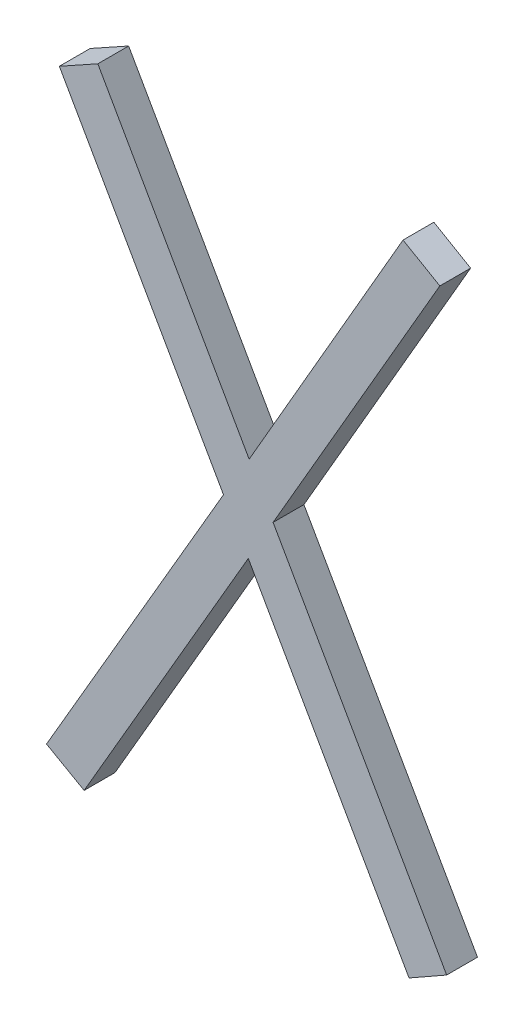
ISO-10303-21;
HEADER;
FILE_DESCRIPTION(('STEP AP214'),'2;1');
FILE_NAME('part.step','',(''),(''),'','','');
FILE_SCHEMA(('AUTOMOTIVE_DESIGN { 1 0 10303 214 1 1 1 1 }'));
ENDSEC;
DATA;
#1=APPLICATION_CONTEXT('core data for automotive mechanical design processes');
#2=APPLICATION_PROTOCOL_DEFINITION('international standard','automotive_design',2000,#1);
#3=PRODUCT_CONTEXT('',#1,'mechanical');
#4=PRODUCT('Part','Part','',(#3));
#5=PRODUCT_RELATED_PRODUCT_CATEGORY('part','',(#4));
#6=PRODUCT_DEFINITION_FORMATION('','',#4);
#7=PRODUCT_DEFINITION_CONTEXT('part definition',#1,'design');
#8=PRODUCT_DEFINITION('design','',#6,#7);
#9=PRODUCT_DEFINITION_SHAPE('','',#8);
#10=(LENGTH_UNIT() NAMED_UNIT(*) SI_UNIT(.MILLI.,.METRE.));
#11=(NAMED_UNIT(*) PLANE_ANGLE_UNIT() SI_UNIT($,.RADIAN.));
#12=(NAMED_UNIT(*) SI_UNIT($,.STERADIAN.) SOLID_ANGLE_UNIT());
#13=UNCERTAINTY_MEASURE_WITH_UNIT(LENGTH_MEASURE(1.E-05),#10,'distance_accuracy_value','');
#14=(GEOMETRIC_REPRESENTATION_CONTEXT(3) GLOBAL_UNCERTAINTY_ASSIGNED_CONTEXT((#13)) GLOBAL_UNIT_ASSIGNED_CONTEXT((#10,
#11,#12)) REPRESENTATION_CONTEXT('',''));
#15=CARTESIAN_POINT('',(0.,0.,0.));
#16=DIRECTION('',(0.,0.,1.));
#17=DIRECTION('',(1.,0.,0.));
#18=AXIS2_PLACEMENT_3D('',#15,#16,#17);
#19=CARTESIAN_POINT('',(91.9707697498928,58.3126359816952,-39.1));
#20=DIRECTION('',(0.,0.,-1.));
#21=DIRECTION('',(-1.,0.,0.));
#22=AXIS2_PLACEMENT_3D('',#19,#20,#21);
#23=PLANE('',#22);
#24=DIRECTION('',(-0.493874000371217,0.869533479376919,0.));
#25=VECTOR('',#24,1.);
#26=CARTESIAN_POINT('',(92.620836084824,59.1640593303503,-39.1));
#27=LINE('',#26,#25);
#28=CARTESIAN_POINT('',(93.1423340043933,58.2458901208959,-39.1));
#29=VERTEX_POINT('',#28);
#30=CARTESIAN_POINT('',(92.6208360848072,59.1640593303407,-39.1));
#31=VERTEX_POINT('',#30);
#32=EDGE_CURVE('E159',#29,#31,#27,.T.);
#33=ORIENTED_EDGE('',*,*,#32,.T.);
#34=DIRECTION('',(-0.501757199087613,-0.865008504677124,0.));
#35=VECTOR('',#34,1.);
#36=CARTESIAN_POINT('',(92.0882424648369,58.2458901209322,-39.1));
#37=LINE('',#36,#35);
#38=CARTESIAN_POINT('',(92.0882424648636,58.2458901209166,-39.1));
#39=VERTEX_POINT('',#38);
#40=EDGE_CURVE('E164',#31,#39,#37,.T.);
#41=ORIENTED_EDGE('',*,*,#40,.T.);
#42=DIRECTION('',(-0.86945655739274,0.494009407609576,0.));
#43=VECTOR('',#42,1.);
#44=CARTESIAN_POINT('',(91.9661897602962,58.3152382485114,-39.1));
#45=LINE('',#44,#43);
#46=CARTESIAN_POINT('',(91.9661897602962,58.3152382485114,-39.1));
#47=VERTEX_POINT('',#46);
#48=EDGE_CURVE('E106',#39,#47,#45,.T.);
#49=ORIENTED_EDGE('',*,*,#48,.T.);
#50=DIRECTION('',(0.502662662857917,0.864482647233933,0.));
#51=VECTOR('',#50,1.);
#52=CARTESIAN_POINT('',(92.5403922568138,59.3027555855175,-39.1));
#53=LINE('',#52,#51);
#54=CARTESIAN_POINT('',(92.540392256802,59.3027555855243,-39.1));
#55=VERTEX_POINT('',#54);
#56=EDGE_CURVE('E20',#47,#55,#53,.T.);
#57=ORIENTED_EDGE('',*,*,#56,.T.);
#58=DIRECTION('',(-0.493921009717616,0.869506777523632,0.));
#59=VECTOR('',#58,1.);
#60=CARTESIAN_POINT('',(92.0077986368354,60.2403422706599,-39.1));
#61=LINE('',#60,#59);
#62=CARTESIAN_POINT('',(92.0077986368628,60.2403422706755,-39.1));
#63=VERTEX_POINT('',#62);
#64=EDGE_CURVE('E103',#55,#63,#61,.T.);
#65=ORIENTED_EDGE('',*,*,#64,.T.);
#66=DIRECTION('',(0.874157276121612,0.485642931178499,0.));
#67=VECTOR('',#66,1.);
#68=CARTESIAN_POINT('',(92.1326252665092,60.3096903982572,-39.1));
#69=LINE('',#68,#67);
#70=CARTESIAN_POINT('',(92.1326252665095,60.3096903982573,-39.1));
#71=VERTEX_POINT('',#70);
#72=EDGE_CURVE('E124',#63,#71,#69,.T.);
#73=ORIENTED_EDGE('',*,*,#72,.T.);
#74=DIRECTION('',(0.493434547487693,-0.869782931164791,0.));
#75=VECTOR('',#74,1.);
#76=CARTESIAN_POINT('',(92.6236100099216,59.4442257658021,-39.1));
#77=LINE('',#76,#75);
#78=CARTESIAN_POINT('',(92.62361000994,59.4442257657843,-39.1));
#79=VERTEX_POINT('',#78);
#80=EDGE_CURVE('E129',#71,#79,#77,.T.);
#81=ORIENTED_EDGE('',*,*,#80,.T.);
#82=DIRECTION('',(0.499722453489593,0.866185586048592,0.));
#83=VECTOR('',#82,1.);
#84=CARTESIAN_POINT('',(93.1229165286308,60.3096903981744,-39.1));
#85=LINE('',#84,#83);
#86=CARTESIAN_POINT('',(93.1229165286308,60.3096903981744,-39.1));
#87=VERTEX_POINT('',#86);
#88=EDGE_CURVE('E134',#79,#87,#85,.T.);
#89=ORIENTED_EDGE('',*,*,#88,.T.);
#90=DIRECTION('',(0.864507186684219,-0.502620457374486,0.));
#91=VECTOR('',#90,1.);
#92=CARTESIAN_POINT('',(93.242195308049,60.2403422706057,-39.1));
#93=LINE('',#92,#91);
#94=CARTESIAN_POINT('',(93.2421953080429,60.2403422706092,-39.1));
#95=VERTEX_POINT('',#94);
#96=EDGE_CURVE('E139',#87,#95,#93,.T.);
#97=ORIENTED_EDGE('',*,*,#96,.T.);
#98=DIRECTION('',(-0.500833770570706,-0.865543490678504,0.));
#99=VECTOR('',#98,1.);
#100=CARTESIAN_POINT('',(92.7012799128295,59.3055295106763,-39.1));
#101=LINE('',#100,#99);
#102=CARTESIAN_POINT('',(92.7012799127852,59.3055295105927,-39.1));
#103=VERTEX_POINT('',#102);
#104=EDGE_CURVE('E144',#95,#103,#101,.T.);
#105=ORIENTED_EDGE('',*,*,#104,.T.);
#106=DIRECTION('',(0.494302224488511,-0.869290118927916,0.));
#107=VECTOR('',#106,1.);
#108=CARTESIAN_POINT('',(93.2643867089025,58.3152382484591,-39.1));
#109=LINE('',#108,#107);
#110=CARTESIAN_POINT('',(93.2643867089059,58.3152382484531,-39.1));
#111=VERTEX_POINT('',#110);
#112=EDGE_CURVE('E149',#103,#111,#109,.T.);
#113=ORIENTED_EDGE('',*,*,#112,.T.);
#114=DIRECTION('',(-0.869456557392783,-0.494009407609501,0.));
#115=VECTOR('',#114,1.);
#116=CARTESIAN_POINT('',(93.1423340043962,58.2458901208908,-39.1));
#117=LINE('',#116,#115);
#118=EDGE_CURVE('E154',#111,#29,#117,.T.);
#119=ORIENTED_EDGE('',*,*,#118,.T.);
#120=EDGE_LOOP('',(#33,#41,#49,#57,#65,#73,#81,#89,#97,#105,#113,#119));
#121=FACE_BOUND('',#120,.T.);
#122=ADVANCED_FACE('F17',(#121),#23,.T.);
#123=CARTESIAN_POINT('',(92.5403922568138,59.3027555855175,-39.));
#124=DIRECTION('',(0.864482647233933,-0.502662662857917,0.));
#125=DIRECTION('',(0.502662662857917,0.864482647233933,0.));
#126=AXIS2_PLACEMENT_3D('',#123,#124,#125);
#127=PLANE('',#126);
#128=DIRECTION('',(0.,0.,1.));
#129=VECTOR('',#128,1.);
#130=CARTESIAN_POINT('',(91.9661897602962,58.3152382485114,-39.));
#131=LINE('',#130,#129);
#132=CARTESIAN_POINT('',(91.9661897602962,58.3152382485114,-39.));
#133=VERTEX_POINT('',#132);
#134=EDGE_CURVE('E166',#47,#133,#131,.T.);
#135=ORIENTED_EDGE('',*,*,#134,.T.);
#136=DIRECTION('',(0.502662662837388,0.864482647245869,0.));
#137=VECTOR('',#136,1.);
#138=CARTESIAN_POINT('',(91.9661897602962,58.3152382485114,-39.));
#139=LINE('',#138,#137);
#140=CARTESIAN_POINT('',(92.540392256802,59.3027555855243,-39.));
#141=VERTEX_POINT('',#140);
#142=EDGE_CURVE('E121',#133,#141,#139,.T.);
#143=ORIENTED_EDGE('',*,*,#142,.T.);
#144=DIRECTION('',(0.,0.,1.));
#145=VECTOR('',#144,1.);
#146=CARTESIAN_POINT('',(92.5403922567903,59.3027555855311,-39.));
#147=LINE('',#146,#145);
#148=EDGE_CURVE('E111',#141,#55,#147,.F.);
#149=ORIENTED_EDGE('',*,*,#148,.T.);
#150=ORIENTED_EDGE('',*,*,#56,.F.);
#151=EDGE_LOOP('',(#135,#143,#149,#150));
#152=FACE_BOUND('',#151,.T.);
#153=ADVANCED_FACE('F120',(#152),#127,.F.);
#154=CARTESIAN_POINT('',(92.0077986368354,60.2403422706599,-39.));
#155=DIRECTION('',(0.869506777523632,0.493921009717616,0.));
#156=DIRECTION('',(-0.493921009717616,0.869506777523632,0.));
#157=AXIS2_PLACEMENT_3D('',#154,#155,#156);
#158=PLANE('',#157);
#159=ORIENTED_EDGE('',*,*,#148,.F.);
#160=DIRECTION('',(-0.493921009666716,0.869506777552545,0.));
#161=VECTOR('',#160,1.);
#162=CARTESIAN_POINT('',(92.5403922567903,59.3027555855311,-39.));
#163=LINE('',#162,#161);
#164=CARTESIAN_POINT('',(92.0077986368628,60.2403422706755,-39.));
#165=VERTEX_POINT('',#164);
#166=EDGE_CURVE('E171',#141,#165,#163,.T.);
#167=ORIENTED_EDGE('',*,*,#166,.T.);
#168=DIRECTION('',(0.,0.,1.));
#169=VECTOR('',#168,1.);
#170=CARTESIAN_POINT('',(92.0077986368903,60.2403422706912,-39.));
#171=LINE('',#170,#169);
#172=EDGE_CURVE('E117',#165,#63,#171,.F.);
#173=ORIENTED_EDGE('',*,*,#172,.T.);
#174=ORIENTED_EDGE('',*,*,#64,.F.);
#175=EDGE_LOOP('',(#159,#167,#173,#174));
#176=FACE_BOUND('',#175,.T.);
#177=ADVANCED_FACE('F114',(#176),#158,.F.);
#178=CARTESIAN_POINT('',(92.1326252665092,60.3096903982572,-39.));
#179=DIRECTION('',(0.485642931178499,-0.874157276121612,0.));
#180=DIRECTION('',(0.874157276121612,0.485642931178499,0.));
#181=AXIS2_PLACEMENT_3D('',#178,#179,#180);
#182=PLANE('',#181);
#183=ORIENTED_EDGE('',*,*,#172,.F.);
#184=DIRECTION('',(0.874157276121609,0.485642931178504,0.));
#185=VECTOR('',#184,1.);
#186=CARTESIAN_POINT('',(92.0077986368903,60.2403422706911,-39.));
#187=LINE('',#186,#185);
#188=CARTESIAN_POINT('',(92.1326252665095,60.3096903982573,-39.));
#189=VERTEX_POINT('',#188);
#190=EDGE_CURVE('E173',#165,#189,#187,.T.);
#191=ORIENTED_EDGE('',*,*,#190,.T.);
#192=DIRECTION('',(0.,0.,1.));
#193=VECTOR('',#192,1.);
#194=CARTESIAN_POINT('',(92.1326252665095,60.3096903982573,-39.));
#195=LINE('',#194,#193);
#196=EDGE_CURVE('E126',#189,#71,#195,.F.);
#197=ORIENTED_EDGE('',*,*,#196,.T.);
#198=ORIENTED_EDGE('',*,*,#72,.F.);
#199=EDGE_LOOP('',(#183,#191,#197,#198));
#200=FACE_BOUND('',#199,.T.);
#201=ADVANCED_FACE('F234',(#200),#182,.F.);
#202=CARTESIAN_POINT('',(92.6236100099216,59.4442257658021,-39.));
#203=DIRECTION('',(-0.869782931164791,-0.493434547487693,0.));
#204=DIRECTION('',(0.493434547487693,-0.869782931164791,0.));
#205=AXIS2_PLACEMENT_3D('',#202,#203,#204);
#206=PLANE('',#205);
#207=ORIENTED_EDGE('',*,*,#196,.F.);
#208=DIRECTION('',(0.493434547500377,-0.869782931157595,0.));
#209=VECTOR('',#208,1.);
#210=CARTESIAN_POINT('',(92.1326252665095,60.3096903982573,-39.));
#211=LINE('',#210,#209);
#212=CARTESIAN_POINT('',(92.62361000994,59.4442257657843,-39.));
#213=VERTEX_POINT('',#212);
#214=EDGE_CURVE('E176',#189,#213,#211,.T.);
#215=ORIENTED_EDGE('',*,*,#214,.T.);
#216=DIRECTION('',(0.,0.,1.));
#217=VECTOR('',#216,1.);
#218=CARTESIAN_POINT('',(92.6236100099463,59.4442257657879,-39.));
#219=LINE('',#218,#217);
#220=EDGE_CURVE('E131',#213,#79,#219,.F.);
#221=ORIENTED_EDGE('',*,*,#220,.T.);
#222=ORIENTED_EDGE('',*,*,#80,.F.);
#223=EDGE_LOOP('',(#207,#215,#221,#222));
#224=FACE_BOUND('',#223,.T.);
#225=ADVANCED_FACE('F231',(#224),#206,.F.);
#226=CARTESIAN_POINT('',(93.1229165286308,60.3096903981744,-39.));
#227=DIRECTION('',(0.866185586048592,-0.499722453489593,0.));
#228=DIRECTION('',(0.499722453489593,0.866185586048592,0.));
#229=AXIS2_PLACEMENT_3D('',#226,#227,#228);
#230=PLANE('',#229);
#231=ORIENTED_EDGE('',*,*,#220,.F.);
#232=DIRECTION('',(0.499722453489568,0.866185586048606,0.));
#233=VECTOR('',#232,1.);
#234=CARTESIAN_POINT('',(92.6236100099463,59.4442257657879,-39.));
#235=LINE('',#234,#233);
#236=CARTESIAN_POINT('',(93.1229165286308,60.3096903981744,-39.));
#237=VERTEX_POINT('',#236);
#238=EDGE_CURVE('E179',#213,#237,#235,.T.);
#239=ORIENTED_EDGE('',*,*,#238,.T.);
#240=DIRECTION('',(0.,0.,1.));
#241=VECTOR('',#240,1.);
#242=CARTESIAN_POINT('',(93.1229165286308,60.3096903981744,-39.));
#243=LINE('',#242,#241);
#244=EDGE_CURVE('E136',#237,#87,#243,.F.);
#245=ORIENTED_EDGE('',*,*,#244,.T.);
#246=ORIENTED_EDGE('',*,*,#88,.F.);
#247=EDGE_LOOP('',(#231,#239,#245,#246));
#248=FACE_BOUND('',#247,.T.);
#249=ADVANCED_FACE('F227',(#248),#230,.F.);
#250=CARTESIAN_POINT('',(93.242195308049,60.2403422706057,-39.));
#251=DIRECTION('',(-0.502620457374486,-0.864507186684219,0.));
#252=DIRECTION('',(0.864507186684219,-0.502620457374486,0.));
#253=AXIS2_PLACEMENT_3D('',#250,#251,#252);
#254=PLANE('',#253);
#255=ORIENTED_EDGE('',*,*,#244,.F.);
#256=DIRECTION('',(0.864507186684126,-0.502620457374645,0.));
#257=VECTOR('',#256,1.);
#258=CARTESIAN_POINT('',(93.1229165286308,60.3096903981744,-39.));
#259=LINE('',#258,#257);
#260=CARTESIAN_POINT('',(93.2421953080429,60.2403422706092,-39.));
#261=VERTEX_POINT('',#260);
#262=EDGE_CURVE('E182',#237,#261,#259,.T.);
#263=ORIENTED_EDGE('',*,*,#262,.T.);
#264=DIRECTION('',(0.,0.,1.));
#265=VECTOR('',#264,1.);
#266=CARTESIAN_POINT('',(93.242195308043,60.2403422706092,-39.));
#267=LINE('',#266,#265);
#268=EDGE_CURVE('E141',#261,#95,#267,.F.);
#269=ORIENTED_EDGE('',*,*,#268,.T.);
#270=ORIENTED_EDGE('',*,*,#96,.F.);
#271=EDGE_LOOP('',(#255,#263,#269,#270));
#272=FACE_BOUND('',#271,.T.);
#273=ADVANCED_FACE('F223',(#272),#254,.F.);
#274=CARTESIAN_POINT('',(92.7012799128295,59.3055295106763,-39.));
#275=DIRECTION('',(-0.865543490678504,0.500833770570706,0.));
#276=DIRECTION('',(-0.500833770570706,-0.865543490678504,0.));
#277=AXIS2_PLACEMENT_3D('',#274,#275,#276);
#278=PLANE('',#277);
#279=ORIENTED_EDGE('',*,*,#268,.F.);
#280=DIRECTION('',(-0.500833770565032,-0.865543490681787,0.));
#281=VECTOR('',#280,1.);
#282=CARTESIAN_POINT('',(93.2421953080429,60.2403422706092,-39.));
#283=LINE('',#282,#281);
#284=CARTESIAN_POINT('',(92.7012799127852,59.3055295105927,-39.));
#285=VERTEX_POINT('',#284);
#286=EDGE_CURVE('E185',#261,#285,#283,.T.);
#287=ORIENTED_EDGE('',*,*,#286,.T.);
#288=DIRECTION('',(0.,0.,1.));
#289=VECTOR('',#288,1.);
#290=CARTESIAN_POINT('',(92.7012799127883,59.3055295105909,-39.));
#291=LINE('',#290,#289);
#292=EDGE_CURVE('E146',#285,#103,#291,.F.);
#293=ORIENTED_EDGE('',*,*,#292,.T.);
#294=ORIENTED_EDGE('',*,*,#104,.F.);
#295=EDGE_LOOP('',(#279,#287,#293,#294));
#296=FACE_BOUND('',#295,.T.);
#297=ADVANCED_FACE('F219',(#296),#278,.F.);
#298=CARTESIAN_POINT('',(93.2643867089025,58.3152382484591,-39.));
#299=DIRECTION('',(-0.869290118927916,-0.494302224488511,0.));
#300=DIRECTION('',(0.494302224488511,-0.869290118927916,0.));
#301=AXIS2_PLACEMENT_3D('',#298,#299,#300);
#302=PLANE('',#301);
#303=ORIENTED_EDGE('',*,*,#292,.F.);
#304=DIRECTION('',(0.494302224488521,-0.86929011892791,0.));
#305=VECTOR('',#304,1.);
#306=CARTESIAN_POINT('',(92.7012799127882,59.3055295105909,-39.));
#307=LINE('',#306,#305);
#308=CARTESIAN_POINT('',(93.2643867089059,58.3152382484531,-39.));
#309=VERTEX_POINT('',#308);
#310=EDGE_CURVE('E188',#285,#309,#307,.T.);
#311=ORIENTED_EDGE('',*,*,#310,.T.);
#312=DIRECTION('',(0.,0.,1.));
#313=VECTOR('',#312,1.);
#314=CARTESIAN_POINT('',(93.2643867089059,58.3152382484531,-39.));
#315=LINE('',#314,#313);
#316=EDGE_CURVE('E151',#309,#111,#315,.F.);
#317=ORIENTED_EDGE('',*,*,#316,.T.);
#318=ORIENTED_EDGE('',*,*,#112,.F.);
#319=EDGE_LOOP('',(#303,#311,#317,#318));
#320=FACE_BOUND('',#319,.T.);
#321=ADVANCED_FACE('F215',(#320),#302,.F.);
#322=CARTESIAN_POINT('',(93.1423340043962,58.2458901208908,-39.));
#323=DIRECTION('',(-0.494009407609501,0.869456557392783,0.));
#324=DIRECTION('',(-0.869456557392783,-0.494009407609501,0.));
#325=AXIS2_PLACEMENT_3D('',#322,#323,#324);
#326=PLANE('',#325);
#327=ORIENTED_EDGE('',*,*,#316,.F.);
#328=DIRECTION('',(-0.869456557434623,-0.494009407535864,0.));
#329=VECTOR('',#328,1.);
#330=CARTESIAN_POINT('',(93.2643867089059,58.3152382484531,-39.));
#331=LINE('',#330,#329);
#332=CARTESIAN_POINT('',(93.1423340043933,58.2458901208959,-39.));
#333=VERTEX_POINT('',#332);
#334=EDGE_CURVE('E191',#309,#333,#331,.T.);
#335=ORIENTED_EDGE('',*,*,#334,.T.);
#336=DIRECTION('',(0.,0.,1.));
#337=VECTOR('',#336,1.);
#338=CARTESIAN_POINT('',(93.1423340043903,58.2458901209011,-39.));
#339=LINE('',#338,#337);
#340=EDGE_CURVE('E156',#333,#29,#339,.F.);
#341=ORIENTED_EDGE('',*,*,#340,.T.);
#342=ORIENTED_EDGE('',*,*,#118,.F.);
#343=EDGE_LOOP('',(#327,#335,#341,#342));
#344=FACE_BOUND('',#343,.T.);
#345=ADVANCED_FACE('F211',(#344),#326,.F.);
#346=CARTESIAN_POINT('',(92.620836084824,59.1640593303503,-39.));
#347=DIRECTION('',(0.869533479376919,0.493874000371217,0.));
#348=DIRECTION('',(-0.493874000371217,0.869533479376919,0.));
#349=AXIS2_PLACEMENT_3D('',#346,#347,#348);
#350=PLANE('',#349);
#351=ORIENTED_EDGE('',*,*,#340,.F.);
#352=DIRECTION('',(-0.49387400040312,0.869533479358799,0.));
#353=VECTOR('',#352,1.);
#354=CARTESIAN_POINT('',(93.1423340043903,58.2458901209011,-39.));
#355=LINE('',#354,#353);
#356=CARTESIAN_POINT('',(92.6208360848072,59.1640593303407,-39.));
#357=VERTEX_POINT('',#356);
#358=EDGE_CURVE('E194',#333,#357,#355,.T.);
#359=ORIENTED_EDGE('',*,*,#358,.T.);
#360=DIRECTION('',(0.,0.,1.));
#361=VECTOR('',#360,1.);
#362=CARTESIAN_POINT('',(92.6208360847903,59.1640593303311,-39.));
#363=LINE('',#362,#361);
#364=EDGE_CURVE('E161',#357,#31,#363,.F.);
#365=ORIENTED_EDGE('',*,*,#364,.T.);
#366=ORIENTED_EDGE('',*,*,#32,.F.);
#367=EDGE_LOOP('',(#351,#359,#365,#366));
#368=FACE_BOUND('',#367,.T.);
#369=ADVANCED_FACE('F207',(#368),#350,.F.);
#370=CARTESIAN_POINT('',(92.0882424648369,58.2458901209322,-39.));
#371=DIRECTION('',(-0.865008504677124,0.501757199087613,0.));
#372=DIRECTION('',(-0.501757199087613,-0.865008504677124,0.));
#373=AXIS2_PLACEMENT_3D('',#370,#371,#372);
#374=PLANE('',#373);
#375=ORIENTED_EDGE('',*,*,#364,.F.);
#376=DIRECTION('',(-0.501757199037244,-0.865008504706341,0.));
#377=VECTOR('',#376,1.);
#378=CARTESIAN_POINT('',(92.6208360847903,59.1640593303311,-39.));
#379=LINE('',#378,#377);
#380=CARTESIAN_POINT('',(92.0882424648636,58.2458901209166,-39.));
#381=VERTEX_POINT('',#380);
#382=EDGE_CURVE('E26',#357,#381,#379,.T.);
#383=ORIENTED_EDGE('',*,*,#382,.T.);
#384=DIRECTION('',(0.,0.,1.));
#385=VECTOR('',#384,1.);
#386=CARTESIAN_POINT('',(92.0882424648903,58.2458901209011,-39.));
#387=LINE('',#386,#385);
#388=EDGE_CURVE('E34',#381,#39,#387,.F.);
#389=ORIENTED_EDGE('',*,*,#388,.T.);
#390=ORIENTED_EDGE('',*,*,#40,.F.);
#391=EDGE_LOOP('',(#375,#383,#389,#390));
#392=FACE_BOUND('',#391,.T.);
#393=ADVANCED_FACE('F200',(#392),#374,.F.);
#394=CARTESIAN_POINT('',(91.9661897602962,58.3152382485114,-39.));
#395=DIRECTION('',(0.494009407609576,0.86945655739274,0.));
#396=DIRECTION('',(-0.86945655739274,0.494009407609576,0.));
#397=AXIS2_PLACEMENT_3D('',#394,#395,#396);
#398=PLANE('',#397);
#399=ORIENTED_EDGE('',*,*,#388,.F.);
#400=DIRECTION('',(-0.869456557392721,0.49400940760961,0.));
#401=VECTOR('',#400,1.);
#402=CARTESIAN_POINT('',(92.0882424648903,58.2458901209011,-39.));
#403=LINE('',#402,#401);
#404=EDGE_CURVE('E11',#381,#133,#403,.T.);
#405=ORIENTED_EDGE('',*,*,#404,.T.);
#406=ORIENTED_EDGE('',*,*,#134,.F.);
#407=ORIENTED_EDGE('',*,*,#48,.F.);
#408=EDGE_LOOP('',(#399,#405,#406,#407));
#409=FACE_BOUND('',#408,.T.);
#410=ADVANCED_FACE('F235',(#409),#398,.F.);
#411=CARTESIAN_POINT('',(91.9707697498928,58.3126359816952,-39.));
#412=DIRECTION('',(0.,0.,-1.));
#413=DIRECTION('',(-1.,0.,0.));
#414=AXIS2_PLACEMENT_3D('',#411,#412,#413);
#415=PLANE('',#414);
#416=ORIENTED_EDGE('',*,*,#382,.F.);
#417=ORIENTED_EDGE('',*,*,#358,.F.);
#418=ORIENTED_EDGE('',*,*,#334,.F.);
#419=ORIENTED_EDGE('',*,*,#310,.F.);
#420=ORIENTED_EDGE('',*,*,#286,.F.);
#421=ORIENTED_EDGE('',*,*,#262,.F.);
#422=ORIENTED_EDGE('',*,*,#238,.F.);
#423=ORIENTED_EDGE('',*,*,#214,.F.);
#424=ORIENTED_EDGE('',*,*,#190,.F.);
#425=ORIENTED_EDGE('',*,*,#166,.F.);
#426=ORIENTED_EDGE('',*,*,#142,.F.);
#427=ORIENTED_EDGE('',*,*,#404,.F.);
#428=EDGE_LOOP('',(#416,#417,#418,#419,#420,#421,#422,#423,#424,#425,#426,#427));
#429=FACE_BOUND('',#428,.T.);
#430=ADVANCED_FACE('F204',(#429),#415,.F.);
#431=CLOSED_SHELL('',(#122,#153,#177,#201,#225,#249,#273,#297,#321,#345,#369,#393,#410,#430));
#432=MANIFOLD_SOLID_BREP('B1',#431);
#433=ADVANCED_BREP_SHAPE_REPRESENTATION('',(#18,#432),#14);
#434=SHAPE_DEFINITION_REPRESENTATION(#9,#433);
ENDSEC;
END-ISO-10303-21;
